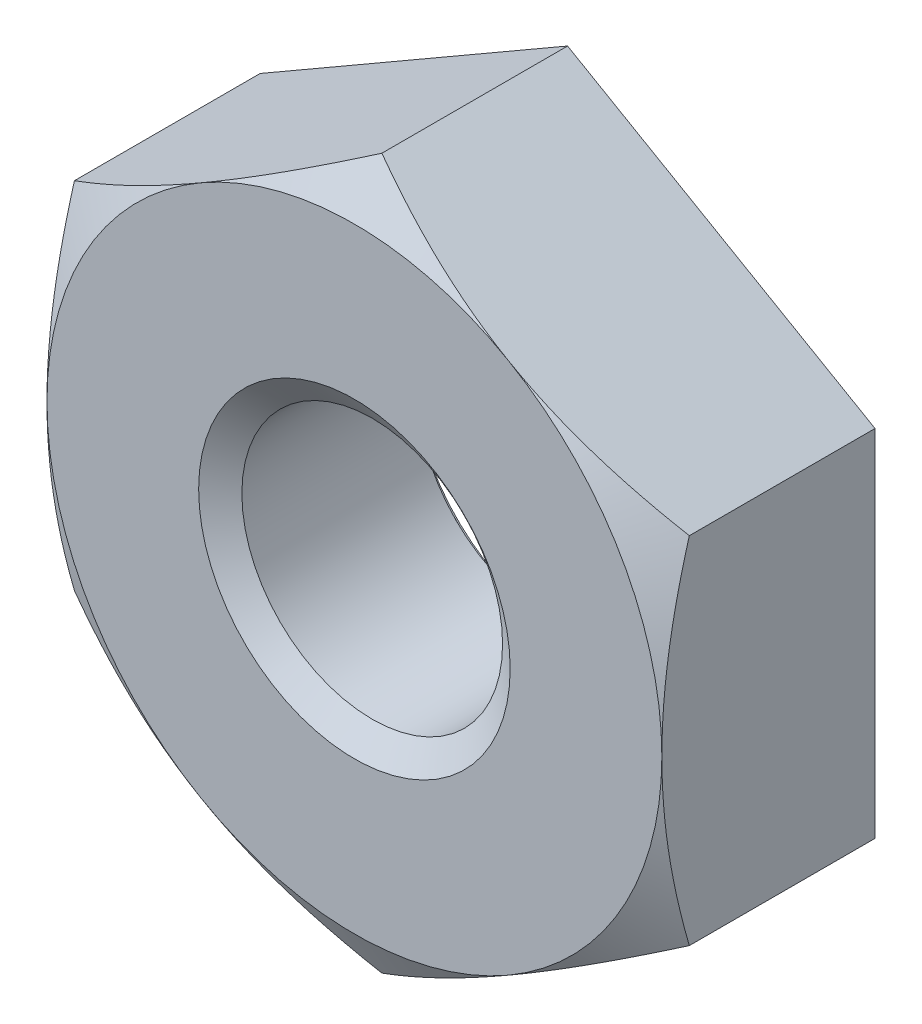
ISO-10303-21;
HEADER;
FILE_DESCRIPTION(('STEP AP214'),'2;1');
FILE_NAME('part.step','',(''),(''),'','','');
FILE_SCHEMA(('AUTOMOTIVE_DESIGN { 1 0 10303 214 1 1 1 1 }'));
ENDSEC;
DATA;
#1=APPLICATION_CONTEXT('core data for automotive mechanical design processes');
#2=APPLICATION_PROTOCOL_DEFINITION('international standard','automotive_design',2000,#1);
#3=PRODUCT_CONTEXT('',#1,'mechanical');
#4=PRODUCT('Part','Part','',(#3));
#5=PRODUCT_RELATED_PRODUCT_CATEGORY('part','',(#4));
#6=PRODUCT_DEFINITION_FORMATION('','',#4);
#7=PRODUCT_DEFINITION_CONTEXT('part definition',#1,'design');
#8=PRODUCT_DEFINITION('design','',#6,#7);
#9=PRODUCT_DEFINITION_SHAPE('','',#8);
#10=(LENGTH_UNIT() NAMED_UNIT(*) SI_UNIT(.MILLI.,.METRE.));
#11=(NAMED_UNIT(*) PLANE_ANGLE_UNIT() SI_UNIT($,.RADIAN.));
#12=(NAMED_UNIT(*) SI_UNIT($,.STERADIAN.) SOLID_ANGLE_UNIT());
#13=UNCERTAINTY_MEASURE_WITH_UNIT(LENGTH_MEASURE(1.E-05),#10,'distance_accuracy_value','');
#14=(GEOMETRIC_REPRESENTATION_CONTEXT(3) GLOBAL_UNCERTAINTY_ASSIGNED_CONTEXT((#13)) GLOBAL_UNIT_ASSIGNED_CONTEXT((#10,
#11,#12)) REPRESENTATION_CONTEXT('',''));
#15=CARTESIAN_POINT('',(0.,0.,0.));
#16=DIRECTION('',(0.,0.,1.));
#17=DIRECTION('',(1.,0.,0.));
#18=AXIS2_PLACEMENT_3D('',#15,#16,#17);
#19=CARTESIAN_POINT('',(0.,0.,-3.302));
#20=DIRECTION('',(0.,0.,1.));
#21=DIRECTION('',(1.,0.,0.));
#22=AXIS2_PLACEMENT_3D('',#19,#20,#21);
#23=CYLINDRICAL_SURFACE('',#22,2.0193);
#24=CARTESIAN_POINT('',(0.,0.,-0.27567170779316));
#25=DIRECTION('',(0.,0.,1.));
#26=DIRECTION('',(1.,0.,0.));
#27=AXIS2_PLACEMENT_3D('',#24,#25,#26);
#28=CIRCLE('',#27,2.0193);
#29=CARTESIAN_POINT('',(2.0193,0.,-0.27567170779316));
#30=VERTEX_POINT('',#29);
#31=EDGE_CURVE('E130',#30,#30,#28,.F.);
#32=ORIENTED_EDGE('',*,*,#31,.F.);
#33=EDGE_LOOP('',(#32));
#34=FACE_BOUND('',#33,.T.);
#35=CARTESIAN_POINT('',(0.,0.,-3.00092829220684));
#36=DIRECTION('',(0.,0.,-1.));
#37=DIRECTION('',(-1.,0.,0.));
#38=AXIS2_PLACEMENT_3D('',#35,#36,#37);
#39=CIRCLE('',#38,2.0193);
#40=CARTESIAN_POINT('',(-2.0193,0.,-3.00092829220684));
#41=VERTEX_POINT('',#40);
#42=EDGE_CURVE('E36',#41,#41,#39,.F.);
#43=ORIENTED_EDGE('',*,*,#42,.F.);
#44=EDGE_LOOP('',(#43));
#45=FACE_BOUND('',#44,.T.);
#46=ADVANCED_FACE('F31',(#34,#45),#23,.F.);
#47=CARTESIAN_POINT('',(0.,5.49926131403119,-3.302));
#48=DIRECTION('',(0.,0.,-1.));
#49=DIRECTION('',(-1.,0.,0.));
#50=AXIS2_PLACEMENT_3D('',#47,#48,#49);
#51=PLANE('',#50);
#52=DIRECTION('',(-0.866025403784438,-0.500000000000001,0.));
#53=VECTOR('',#52,1.);
#54=CARTESIAN_POINT('',(0.,5.49926131403119,-3.302));
#55=LINE('',#54,#53);
#56=CARTESIAN_POINT('',(0.,5.49926131403119,-3.302));
#57=VERTEX_POINT('',#56);
#58=CARTESIAN_POINT('',(-4.7625,2.74963065701559,-3.302));
#59=VERTEX_POINT('',#58);
#60=EDGE_CURVE('E257',#57,#59,#55,.T.);
#61=ORIENTED_EDGE('',*,*,#60,.F.);
#62=DIRECTION('',(-0.866025403784439,0.5,0.));
#63=VECTOR('',#62,1.);
#64=CARTESIAN_POINT('',(4.7625,2.74963065701559,-3.302));
#65=LINE('',#64,#63);
#66=CARTESIAN_POINT('',(4.7625,2.74963065701559,-3.302));
#67=VERTEX_POINT('',#66);
#68=EDGE_CURVE('E234',#67,#57,#65,.T.);
#69=ORIENTED_EDGE('',*,*,#68,.F.);
#70=DIRECTION('',(0.,-1.,0.));
#71=VECTOR('',#70,1.);
#72=CARTESIAN_POINT('',(4.7625,2.74963065701559,-3.302));
#73=LINE('',#72,#71);
#74=CARTESIAN_POINT('',(4.7625,-2.7496306570156,-3.302));
#75=VERTEX_POINT('',#74);
#76=EDGE_CURVE('E246',#67,#75,#73,.T.);
#77=ORIENTED_EDGE('',*,*,#76,.T.);
#78=DIRECTION('',(0.866025403784438,0.5,0.));
#79=VECTOR('',#78,1.);
#80=CARTESIAN_POINT('',(0.,-5.49926131403119,-3.302));
#81=LINE('',#80,#79);
#82=CARTESIAN_POINT('',(0.,-5.49926131403119,-3.302));
#83=VERTEX_POINT('',#82);
#84=EDGE_CURVE('E248',#83,#75,#81,.T.);
#85=ORIENTED_EDGE('',*,*,#84,.F.);
#86=DIRECTION('',(0.866025403784439,-0.5,0.));
#87=VECTOR('',#86,1.);
#88=CARTESIAN_POINT('',(-4.7625,-2.7496306570156,-3.302));
#89=LINE('',#88,#87);
#90=CARTESIAN_POINT('',(-4.7625,-2.7496306570156,-3.302));
#91=VERTEX_POINT('',#90);
#92=EDGE_CURVE('E251',#91,#83,#89,.T.);
#93=ORIENTED_EDGE('',*,*,#92,.F.);
#94=DIRECTION('',(0.,-1.,0.));
#95=VECTOR('',#94,1.);
#96=CARTESIAN_POINT('',(-4.7625,2.74963065701559,-3.302));
#97=LINE('',#96,#95);
#98=EDGE_CURVE('E254',#59,#91,#97,.T.);
#99=ORIENTED_EDGE('',*,*,#98,.F.);
#100=EDGE_LOOP('',(#61,#69,#77,#85,#93,#99));
#101=FACE_BOUND('',#100,.T.);
#102=CARTESIAN_POINT('',(0.,0.,-3.302));
#103=DIRECTION('',(0.,0.,-1.));
#104=DIRECTION('',(-1.,0.,0.));
#105=AXIS2_PLACEMENT_3D('',#102,#103,#104);
#106=CIRCLE('',#105,2.413);
#107=CARTESIAN_POINT('',(-2.413,0.,-3.302));
#108=VERTEX_POINT('',#107);
#109=EDGE_CURVE('E218',#108,#108,#106,.F.);
#110=ORIENTED_EDGE('',*,*,#109,.T.);
#111=EDGE_LOOP('',(#110));
#112=FACE_BOUND('',#111,.T.);
#113=ADVANCED_FACE('F205',(#101,#112),#51,.T.);
#114=CARTESIAN_POINT('',(0.,5.49926131403119,0.));
#115=DIRECTION('',(0.,0.,-1.));
#116=DIRECTION('',(-1.,0.,0.));
#117=AXIS2_PLACEMENT_3D('',#114,#115,#116);
#118=PLANE('',#117);
#119=CARTESIAN_POINT('',(0.,0.,0.));
#120=DIRECTION('',(0.,0.,-1.));
#121=DIRECTION('',(-1.,0.,0.));
#122=AXIS2_PLACEMENT_3D('',#119,#120,#121);
#123=CIRCLE('',#122,4.7625);
#124=CARTESIAN_POINT('',(-2.38125,4.12444598552339,0.));
#125=VERTEX_POINT('',#124);
#126=CARTESIAN_POINT('',(-4.7625,0.,0.));
#127=VERTEX_POINT('',#126);
#128=EDGE_CURVE('E43',#125,#127,#123,.F.);
#129=ORIENTED_EDGE('',*,*,#128,.T.);
#130=CARTESIAN_POINT('',(-2.38125,-4.12444598552339,0.));
#131=VERTEX_POINT('',#130);
#132=EDGE_CURVE('E11',#127,#131,#123,.F.);
#133=ORIENTED_EDGE('',*,*,#132,.T.);
#134=CARTESIAN_POINT('',(2.38125,-4.12444598552339,0.));
#135=VERTEX_POINT('',#134);
#136=EDGE_CURVE('E41',#131,#135,#123,.F.);
#137=ORIENTED_EDGE('',*,*,#136,.T.);
#138=CARTESIAN_POINT('',(4.7625,0.,0.));
#139=VERTEX_POINT('',#138);
#140=EDGE_CURVE('E109',#135,#139,#123,.F.);
#141=ORIENTED_EDGE('',*,*,#140,.T.);
#142=CARTESIAN_POINT('',(0.,0.,0.));
#143=DIRECTION('',(0.,0.,1.));
#144=DIRECTION('',(1.,0.,0.));
#145=AXIS2_PLACEMENT_3D('',#142,#143,#144);
#146=CIRCLE('',#145,4.7625);
#147=CARTESIAN_POINT('',(2.38125,4.12444598552339,0.));
#148=VERTEX_POINT('',#147);
#149=EDGE_CURVE('E121',#139,#148,#146,.T.);
#150=ORIENTED_EDGE('',*,*,#149,.T.);
#151=EDGE_CURVE('E136',#148,#125,#123,.F.);
#152=ORIENTED_EDGE('',*,*,#151,.T.);
#153=EDGE_LOOP('',(#129,#133,#137,#141,#150,#152));
#154=FACE_BOUND('',#153,.T.);
#155=CARTESIAN_POINT('',(0.,0.,0.));
#156=DIRECTION('',(0.,0.,1.));
#157=DIRECTION('',(1.,0.,0.));
#158=AXIS2_PLACEMENT_3D('',#155,#156,#157);
#159=CIRCLE('',#158,2.413);
#160=CARTESIAN_POINT('',(2.413,0.,0.));
#161=VERTEX_POINT('',#160);
#162=EDGE_CURVE('E217',#161,#161,#159,.T.);
#163=ORIENTED_EDGE('',*,*,#162,.F.);
#164=EDGE_LOOP('',(#163));
#165=FACE_BOUND('',#164,.T.);
#166=ADVANCED_FACE('F133',(#154,#165),#118,.F.);
#167=CARTESIAN_POINT('',(0.,5.49926131403119,-3.302));
#168=DIRECTION('',(-0.5,0.866025403784438,0.));
#169=DIRECTION('',(-0.866025403784438,-0.500000000000001,0.));
#170=AXIS2_PLACEMENT_3D('',#167,#168,#169);
#171=PLANE('',#170);
#172=DIRECTION('',(0.,0.,1.));
#173=VECTOR('',#172,1.);
#174=CARTESIAN_POINT('',(-4.7625,2.74963065701559,-3.302));
#175=LINE('',#174,#173);
#176=CARTESIAN_POINT('',(-4.7625,2.74963065701559,-0.42536934298441));
#177=VERTEX_POINT('',#176);
#178=EDGE_CURVE('E230',#59,#177,#175,.T.);
#179=ORIENTED_EDGE('',*,*,#178,.T.);
#180=CARTESIAN_POINT('',(-4.7627,2.74951518696175,-0.425436011750768));
#181=CARTESIAN_POINT('',(-4.55340263838612,2.8703530750302,-0.355653612413945));
#182=CARTESIAN_POINT('',(-4.34231515161877,2.9922244923379,-0.292183264615225));
#183=CARTESIAN_POINT('',(-3.91648500907589,3.23807763976409,-0.181395196068724));
#184=CARTESIAN_POINT('',(-3.701734787416,3.36206373804796,-0.134116665429796));
#185=CARTESIAN_POINT('',(-3.27486304406647,3.60851825398025,-0.0605335253687851));
#186=CARTESIAN_POINT('',(-3.06280800150458,3.73094828988637,-0.0337387922017274));
#187=CARTESIAN_POINT('',(-2.7439794939507,3.91502401454793,-0.00971112218087747));
#188=CARTESIAN_POINT('',(-2.63763059112771,3.97642458222081,-0.00439464100931433));
#189=CARTESIAN_POINT('',(-2.42483449751002,4.09928246415348,0.000759836568293844));
#190=CARTESIAN_POINT('',(-2.31838730985274,4.1607397766019,0.000598002190792765));
#191=CARTESIAN_POINT('',(-2.02675051194544,4.32911636037927,-0.00738494982191029));
#192=CARTESIAN_POINT('',(-1.84165753319303,4.43597984148709,-0.0207924204878941));
#193=CARTESIAN_POINT('',(-1.47270002105863,4.64899756043742,-0.0633078628436922));
#194=CARTESIAN_POINT('',(-1.28883678458933,4.75515104950704,-0.0924303682801015));
#195=CARTESIAN_POINT('',(-0.919135889202232,4.96859796097843,-0.165229253586901));
#196=CARTESIAN_POINT('',(-0.733344890273213,5.07586444422311,-0.209214113046655));
#197=CARTESIAN_POINT('',(-0.364533730991679,5.28879766631444,-0.309042279938828));
#198=CARTESIAN_POINT('',(-0.181508846544093,5.39446713261866,-0.364862134678058));
#199=CARTESIAN_POINT('',(0.000199999999998928,5.49937678408502,-0.425436011750769));
#200=B_SPLINE_CURVE_WITH_KNOTS('',3,(#180,#181,#182,#183,#184,#185,#186,#187,#188,#189,#190,
#191,#192,#193,#194,#195,#196,#197,#198,#199),.UNSPECIFIED.,.F.,.F.,(4,2,2,2,2,2,2,2,2,4),(0.,
0.754910190012918,1.51163483480638,2.24963134670895,2.61827336240839,2.9869039913527,
3.6286742319225,4.27103902109237,4.92765153591996,5.58297484368455),.UNSPECIFIED.);
#201=EDGE_CURVE('E55',#177,#125,#200,.T.);
#202=ORIENTED_EDGE('',*,*,#201,.T.);
#203=CARTESIAN_POINT('',(0.,5.49926131403119,-0.425369342984409));
#204=VERTEX_POINT('',#203);
#205=EDGE_CURVE('E144',#125,#204,#200,.T.);
#206=ORIENTED_EDGE('',*,*,#205,.T.);
#207=DIRECTION('',(0.,0.,1.));
#208=VECTOR('',#207,1.);
#209=CARTESIAN_POINT('',(0.,5.49926131403119,-3.302));
#210=LINE('',#209,#208);
#211=EDGE_CURVE('E229',#57,#204,#210,.T.);
#212=ORIENTED_EDGE('',*,*,#211,.F.);
#213=ORIENTED_EDGE('',*,*,#60,.T.);
#214=EDGE_LOOP('',(#179,#202,#206,#212,#213));
#215=FACE_BOUND('',#214,.T.);
#216=ADVANCED_FACE('F33',(#215),#171,.T.);
#217=CARTESIAN_POINT('',(4.7625,2.74963065701559,-3.302));
#218=DIRECTION('',(0.5,0.866025403784438,0.));
#219=DIRECTION('',(-0.866025403784439,0.5,0.));
#220=AXIS2_PLACEMENT_3D('',#217,#218,#219);
#221=PLANE('',#220);
#222=ORIENTED_EDGE('',*,*,#211,.T.);
#223=CARTESIAN_POINT('',(-0.00020000000000067,5.49937678408502,-0.425436011750769));
#224=CARTESIAN_POINT('',(0.209097361613878,5.37853889601657,-0.355653612413946));
#225=CARTESIAN_POINT('',(0.420184848381228,5.25666747870888,-0.292183264615225));
#226=CARTESIAN_POINT('',(0.846014990924114,5.01081433128269,-0.181395196068724));
#227=CARTESIAN_POINT('',(1.060765212584,4.88682823299882,-0.134116665429797));
#228=CARTESIAN_POINT('',(1.48763695593353,4.64037371706653,-0.0605335253687856));
#229=CARTESIAN_POINT('',(1.69969199849542,4.51794368116041,-0.0337387922017277));
#230=CARTESIAN_POINT('',(2.0185205060493,4.33386795649884,-0.00971112218087749));
#231=CARTESIAN_POINT('',(2.12486940887228,4.27246738882597,-0.00439464100931429));
#232=CARTESIAN_POINT('',(2.33766550248998,4.14960950689329,0.000759836568294039));
#233=CARTESIAN_POINT('',(2.44411269014726,4.08815219444488,0.000598002190793063));
#234=CARTESIAN_POINT('',(2.73574948805456,3.9197756106675,-0.00738494982190979));
#235=CARTESIAN_POINT('',(2.92084246680697,3.81291212955969,-0.0207924204878935));
#236=CARTESIAN_POINT('',(3.28979997894137,3.59989441060936,-0.0633078628436916));
#237=CARTESIAN_POINT('',(3.47366321541067,3.49374092153973,-0.092430368280101));
#238=CARTESIAN_POINT('',(3.84336411079777,3.28029401006835,-0.165229253586901));
#239=CARTESIAN_POINT('',(4.02915510972679,3.17302752682367,-0.209214113046654));
#240=CARTESIAN_POINT('',(4.39796626900832,2.96009430473234,-0.309042279938827));
#241=CARTESIAN_POINT('',(4.58099115345591,2.85442483842812,-0.364862134678057));
#242=CARTESIAN_POINT('',(4.7627,2.74951518696175,-0.425436011750768));
#243=B_SPLINE_CURVE_WITH_KNOTS('',3,(#223,#224,#225,#226,#227,#228,#229,#230,#231,#232,#233,
#234,#235,#236,#237,#238,#239,#240,#241,#242),.UNSPECIFIED.,.F.,.F.,(4,2,2,2,2,2,2,2,2,4),(0.,
0.754910190012917,1.51163483480638,2.24963134670895,2.61827336240839,2.9869039913527,
3.6286742319225,4.27103902109237,4.92765153591996,5.58297484368455),.UNSPECIFIED.);
#244=EDGE_CURVE('E141',#204,#148,#243,.T.);
#245=ORIENTED_EDGE('',*,*,#244,.T.);
#246=CARTESIAN_POINT('',(4.7625,2.74963065701559,-0.425369342984409));
#247=VERTEX_POINT('',#246);
#248=EDGE_CURVE('E124',#148,#247,#243,.T.);
#249=ORIENTED_EDGE('',*,*,#248,.T.);
#250=DIRECTION('',(0.,0.,1.));
#251=VECTOR('',#250,1.);
#252=CARTESIAN_POINT('',(4.7625,2.74963065701559,-3.302));
#253=LINE('',#252,#251);
#254=EDGE_CURVE('E140',#67,#247,#253,.T.);
#255=ORIENTED_EDGE('',*,*,#254,.F.);
#256=ORIENTED_EDGE('',*,*,#68,.T.);
#257=EDGE_LOOP('',(#222,#245,#249,#255,#256));
#258=FACE_BOUND('',#257,.T.);
#259=ADVANCED_FACE('F262',(#258),#221,.T.);
#260=CARTESIAN_POINT('',(4.7625,2.74963065701559,-3.302));
#261=DIRECTION('',(-1.,0.,0.));
#262=DIRECTION('',(0.,0.,1.));
#263=AXIS2_PLACEMENT_3D('',#260,#261,#262);
#264=PLANE('',#263);
#265=CARTESIAN_POINT('',(4.7625,-7.29242571304484,-2.27898343403964));
#266=CARTESIAN_POINT('',(4.7625,-7.08332503258644,-2.17793443460892));
#267=CARTESIAN_POINT('',(4.7625,-6.87372996761939,-2.07788994627171));
#268=CARTESIAN_POINT('',(4.7625,-6.45328375890254,-1.88038400304187));
#269=CARTESIAN_POINT('',(4.7625,-6.24243240531598,-1.78292299537275));
#270=CARTESIAN_POINT('',(4.7625,-5.818067307616,-1.59064459480452));
#271=CARTESIAN_POINT('',(4.7625,-5.60454523269943,-1.49584552190854));
#272=CARTESIAN_POINT('',(4.7625,-5.17574610716181,-1.31031922922938));
#273=CARTESIAN_POINT('',(4.7625,-4.96046914871243,-1.21959179719919));
#274=CARTESIAN_POINT('',(4.7625,-4.5251454275538,-1.04221436450315));
#275=CARTESIAN_POINT('',(4.7625,-4.30507255346546,-0.955628096677137));
#276=CARTESIAN_POINT('',(4.7625,-3.86233085885286,-0.789237026079921));
#277=CARTESIAN_POINT('',(4.7625,-3.6396617526365,-0.709432977795151));
#278=CARTESIAN_POINT('',(4.7625,-3.19183146915336,-0.558750437330524));
#279=CARTESIAN_POINT('',(4.7625,-2.96667674136295,-0.487852969464109));
#280=CARTESIAN_POINT('',(4.7625,-2.51316408606383,-0.357286935151366));
#281=CARTESIAN_POINT('',(4.7625,-2.28480719615868,-0.297614817726104));
#282=CARTESIAN_POINT('',(4.7625,-1.82474524250015,-0.192393335725106));
#283=CARTESIAN_POINT('',(4.7625,-1.59303930440612,-0.146847731515044));
#284=CARTESIAN_POINT('',(4.7625,-1.12680140245445,-0.0729572667243255));
#285=CARTESIAN_POINT('',(4.7625,-0.892269436098447,-0.044612421351302));
#286=CARTESIAN_POINT('',(4.7625,-0.540098243423059,-0.0168127698224292));
#287=CARTESIAN_POINT('',(4.7625,-0.423010288487476,-0.00999774479560567));
#288=CARTESIAN_POINT('',(4.7625,-0.188645495023605,-0.00132916739532982));
#289=CARTESIAN_POINT('',(4.7625,-0.0713686589679978,0.000524449409052416));
#290=CARTESIAN_POINT('',(4.7625,0.163123105354889,-0.00077959532675014));
#291=CARTESIAN_POINT('',(4.7625,0.280338041752276,-0.00393584200216364));
#292=CARTESIAN_POINT('',(4.7625,0.514533140154533,-0.0151795737408435));
#293=CARTESIAN_POINT('',(4.7625,0.631513289308025,-0.0232673217280265));
#294=CARTESIAN_POINT('',(4.7625,0.915050030184752,-0.0486788919016494));
#295=CARTESIAN_POINT('',(4.7625,1.08138937418057,-0.0684745311551046));
#296=CARTESIAN_POINT('',(4.7625,1.41276151801412,-0.116933997609662));
#297=CARTESIAN_POINT('',(4.7625,1.57779414061616,-0.145599007360524));
#298=CARTESIAN_POINT('',(4.7625,2.07083902042289,-0.243383100627567));
#299=CARTESIAN_POINT('',(4.7625,2.39654516294854,-0.324265654459847));
#300=CARTESIAN_POINT('',(4.7625,2.88391142522151,-0.463767781303893));
#301=CARTESIAN_POINT('',(4.7625,3.04811363656015,-0.514009375908408));
#302=CARTESIAN_POINT('',(4.7625,3.37480455011008,-0.619463864370054));
#303=CARTESIAN_POINT('',(4.7625,3.53729434901436,-0.674673329356533));
#304=CARTESIAN_POINT('',(4.7625,3.85988055284394,-0.788914900372858));
#305=CARTESIAN_POINT('',(4.7625,4.01998528140539,-0.847923740867389));
#306=CARTESIAN_POINT('',(4.7625,4.33895253974561,-0.969404920092012));
#307=CARTESIAN_POINT('',(4.7625,4.49781453744471,-1.03187865865025));
#308=CARTESIAN_POINT('',(4.7625,4.65610216606021,-1.09574291091383));
#309=B_SPLINE_CURVE_WITH_KNOTS('',3,(#265,#266,#267,#268,#269,#270,#271,#272,#273,#274,#275,
#276,#277,#278,#279,#280,#281,#282,#283,#284,#285,#286,#287,#288,#289,#290,#291,#292,#293,#294,
#295,#296,#297,#298,#299,#300,#301,#302,#303,#304,#305,#306,#307,#308),.UNSPECIFIED.,.F.,.F.,(4,
2,2,2,2,2,2,2,2,2,2,2,2,2,2,2,2,2,2,2,2,4),(0.,0.696720165483736,1.39356016205725,
2.09438789250382,2.79517904757872,3.50457374312629,4.21404725210227,4.92198260780581,
5.62969364031721,6.33759289852653,7.04549278260687,7.39726182154395,7.74902629223847,
8.10069143675107,8.45237533199633,8.95462912158064,9.45694990534677,10.4623513294482,
10.9774608355396,11.4922174961111,12.0040767603637,12.5161443452105),.UNSPECIFIED.);
#310=CARTESIAN_POINT('',(4.7625,-2.74963065701559,-0.425369342984409));
#311=VERTEX_POINT('',#310);
#312=EDGE_CURVE('E105',#311,#139,#309,.T.);
#313=ORIENTED_EDGE('',*,*,#312,.F.);
#314=DIRECTION('',(0.,0.,1.));
#315=VECTOR('',#314,1.);
#316=CARTESIAN_POINT('',(4.7625,-2.7496306570156,-3.302));
#317=LINE('',#316,#315);
#318=EDGE_CURVE('E239',#75,#311,#317,.T.);
#319=ORIENTED_EDGE('',*,*,#318,.F.);
#320=ORIENTED_EDGE('',*,*,#76,.F.);
#321=ORIENTED_EDGE('',*,*,#254,.T.);
#322=EDGE_CURVE('E118',#139,#247,#309,.T.);
#323=ORIENTED_EDGE('',*,*,#322,.F.);
#324=EDGE_LOOP('',(#313,#319,#320,#321,#323));
#325=FACE_BOUND('',#324,.T.);
#326=ADVANCED_FACE('F138',(#325),#264,.F.);
#327=CARTESIAN_POINT('',(0.,-5.49926131403119,-3.302));
#328=DIRECTION('',(0.5,-0.866025403784438,0.));
#329=DIRECTION('',(0.866025403784438,0.5,0.));
#330=AXIS2_PLACEMENT_3D('',#327,#328,#329);
#331=PLANE('',#330);
#332=ORIENTED_EDGE('',*,*,#318,.T.);
#333=CARTESIAN_POINT('',(4.7627,-2.74951518696176,-0.425436011750769));
#334=CARTESIAN_POINT('',(4.55340263838612,-2.87035307503021,-0.355653612413947));
#335=CARTESIAN_POINT('',(4.34231515161877,-2.9922244923379,-0.292183264615227));
#336=CARTESIAN_POINT('',(3.91648500907589,-3.23807763976409,-0.181395196068726));
#337=CARTESIAN_POINT('',(3.701734787416,-3.36206373804796,-0.134116665429798));
#338=CARTESIAN_POINT('',(3.27486304406647,-3.60851825398026,-0.0605335253687871));
#339=CARTESIAN_POINT('',(3.06280800150458,-3.73094828988638,-0.0337387922017295));
#340=CARTESIAN_POINT('',(2.7439794939507,-3.91502401454794,-0.0097111221808794));
#341=CARTESIAN_POINT('',(2.63763059112771,-3.97642458222081,-0.00439464100931616));
#342=CARTESIAN_POINT('',(2.42483449751002,-4.09928246415349,0.000759836568291913));
#343=CARTESIAN_POINT('',(2.31838730985274,-4.1607397766019,0.000598002190790622));
#344=CARTESIAN_POINT('',(2.02675051194544,-4.32911636037928,-0.00738494982191273));
#345=CARTESIAN_POINT('',(1.84165753319303,-4.43597984148709,-0.0207924204878963));
#346=CARTESIAN_POINT('',(1.47270002105863,-4.64899756043742,-0.0633078628436945));
#347=CARTESIAN_POINT('',(1.28883678458933,-4.75515104950705,-0.0924303682801041));
#348=CARTESIAN_POINT('',(0.919135889202232,-4.96859796097843,-0.165229253586904));
#349=CARTESIAN_POINT('',(0.733344890273213,-5.07586444422311,-0.209214113046657));
#350=CARTESIAN_POINT('',(0.364533730991679,-5.28879766631445,-0.30904227993883));
#351=CARTESIAN_POINT('',(0.181508846544093,-5.39446713261866,-0.36486213467806));
#352=CARTESIAN_POINT('',(-0.000199999999998893,-5.49937678408503,-0.425436011750771));
#353=B_SPLINE_CURVE_WITH_KNOTS('',3,(#333,#334,#335,#336,#337,#338,#339,#340,#341,#342,#343,
#344,#345,#346,#347,#348,#349,#350,#351,#352),.UNSPECIFIED.,.F.,.F.,(4,2,2,2,2,2,2,2,2,4),(0.,
0.754910190012918,1.51163483480638,2.24963134670895,2.61827336240839,2.9869039913527,
3.6286742319225,4.27103902109237,4.92765153591996,5.58297484368455),.UNSPECIFIED.);
#354=EDGE_CURVE('E112',#311,#135,#353,.T.);
#355=ORIENTED_EDGE('',*,*,#354,.T.);
#356=CARTESIAN_POINT('',(0.,-5.49926131403119,-0.425369342984409));
#357=VERTEX_POINT('',#356);
#358=EDGE_CURVE('E151',#135,#357,#353,.T.);
#359=ORIENTED_EDGE('',*,*,#358,.T.);
#360=DIRECTION('',(0.,0.,1.));
#361=VECTOR('',#360,1.);
#362=CARTESIAN_POINT('',(0.,-5.49926131403119,-3.302));
#363=LINE('',#362,#361);
#364=EDGE_CURVE('E236',#83,#357,#363,.T.);
#365=ORIENTED_EDGE('',*,*,#364,.F.);
#366=ORIENTED_EDGE('',*,*,#84,.T.);
#367=EDGE_LOOP('',(#332,#355,#359,#365,#366));
#368=FACE_BOUND('',#367,.T.);
#369=ADVANCED_FACE('F193',(#368),#331,.T.);
#370=CARTESIAN_POINT('',(-4.7625,-2.7496306570156,-3.302));
#371=DIRECTION('',(-0.5,-0.866025403784438,0.));
#372=DIRECTION('',(0.866025403784439,-0.5,0.));
#373=AXIS2_PLACEMENT_3D('',#370,#371,#372);
#374=PLANE('',#373);
#375=ORIENTED_EDGE('',*,*,#364,.T.);
#376=CARTESIAN_POINT('',(0.000200000000000501,-5.49937678408503,-0.425436011750772));
#377=CARTESIAN_POINT('',(-0.209097361613878,-5.37853889601658,-0.355653612413949));
#378=CARTESIAN_POINT('',(-0.420184848381229,-5.25666747870889,-0.292183264615228));
#379=CARTESIAN_POINT('',(-0.846014990924115,-5.01081433128269,-0.181395196068727));
#380=CARTESIAN_POINT('',(-1.060765212584,-4.88682823299882,-0.134116665429799));
#381=CARTESIAN_POINT('',(-1.48763695593353,-4.64037371706653,-0.0605335253687881));
#382=CARTESIAN_POINT('',(-1.69969199849542,-4.51794368116041,-0.0337387922017307));
#383=CARTESIAN_POINT('',(-2.0185205060493,-4.33386795649885,-0.00971112218088012));
#384=CARTESIAN_POINT('',(-2.12486940887229,-4.27246738882597,-0.00439464100931657));
#385=CARTESIAN_POINT('',(-2.33766550248998,-4.1496095068933,0.000759836568291579));
#386=CARTESIAN_POINT('',(-2.44411269014727,-4.08815219444489,0.000598002190790061));
#387=CARTESIAN_POINT('',(-2.73574948805456,-3.91977561066751,-0.00738494982191347));
#388=CARTESIAN_POINT('',(-2.92084246680697,-3.8129121295597,-0.0207924204878967));
#389=CARTESIAN_POINT('',(-3.28979997894137,-3.59989441060936,-0.0633078628436941));
#390=CARTESIAN_POINT('',(-3.47366321541067,-3.49374092153974,-0.0924303682801032));
#391=CARTESIAN_POINT('',(-3.84336411079777,-3.28029401006835,-0.165229253586903));
#392=CARTESIAN_POINT('',(-4.02915510972679,-3.17302752682367,-0.209214113046656));
#393=CARTESIAN_POINT('',(-4.39796626900832,-2.96009430473234,-0.309042279938829));
#394=CARTESIAN_POINT('',(-4.58099115345591,-2.85442483842813,-0.364862134678059));
#395=CARTESIAN_POINT('',(-4.7627,-2.74951518696176,-0.42543601175077));
#396=B_SPLINE_CURVE_WITH_KNOTS('',3,(#376,#377,#378,#379,#380,#381,#382,#383,#384,#385,#386,
#387,#388,#389,#390,#391,#392,#393,#394,#395),.UNSPECIFIED.,.F.,.F.,(4,2,2,2,2,2,2,2,2,4),(0.,
0.754910190012919,1.51163483480638,2.24963134670895,2.6182733624084,2.9869039913527,
3.6286742319225,4.27103902109237,4.92765153591997,5.58297484368455),.UNSPECIFIED.);
#397=EDGE_CURVE('E187',#357,#131,#396,.T.);
#398=ORIENTED_EDGE('',*,*,#397,.T.);
#399=CARTESIAN_POINT('',(-4.7625,-2.74963065701559,-0.425369342984409));
#400=VERTEX_POINT('',#399);
#401=EDGE_CURVE('E180',#131,#400,#396,.T.);
#402=ORIENTED_EDGE('',*,*,#401,.T.);
#403=DIRECTION('',(0.,0.,1.));
#404=VECTOR('',#403,1.);
#405=CARTESIAN_POINT('',(-4.7625,-2.7496306570156,-3.302));
#406=LINE('',#405,#404);
#407=EDGE_CURVE('E233',#91,#400,#406,.T.);
#408=ORIENTED_EDGE('',*,*,#407,.F.);
#409=ORIENTED_EDGE('',*,*,#92,.T.);
#410=EDGE_LOOP('',(#375,#398,#402,#408,#409));
#411=FACE_BOUND('',#410,.T.);
#412=ADVANCED_FACE('F189',(#411),#374,.T.);
#413=CARTESIAN_POINT('',(-4.7625,2.74963065701559,-3.302));
#414=DIRECTION('',(-1.,0.,0.));
#415=DIRECTION('',(0.,0.,1.));
#416=AXIS2_PLACEMENT_3D('',#413,#414,#415);
#417=PLANE('',#416);
#418=ORIENTED_EDGE('',*,*,#407,.T.);
#419=CARTESIAN_POINT('',(-4.7625,-7.29242571304484,-2.27898343403964));
#420=CARTESIAN_POINT('',(-4.7625,-7.08332503258644,-2.17793443460892));
#421=CARTESIAN_POINT('',(-4.7625,-6.87372996761939,-2.07788994627171));
#422=CARTESIAN_POINT('',(-4.7625,-6.45328375890254,-1.88038400304187));
#423=CARTESIAN_POINT('',(-4.7625,-6.24243240531598,-1.78292299537275));
#424=CARTESIAN_POINT('',(-4.7625,-5.818067307616,-1.59064459480452));
#425=CARTESIAN_POINT('',(-4.7625,-5.60454523269943,-1.49584552190854));
#426=CARTESIAN_POINT('',(-4.7625,-5.17574610716181,-1.31031922922938));
#427=CARTESIAN_POINT('',(-4.7625,-4.96046914871243,-1.21959179719919));
#428=CARTESIAN_POINT('',(-4.7625,-4.5251454275538,-1.04221436450315));
#429=CARTESIAN_POINT('',(-4.7625,-4.30507255346547,-0.955628096677138));
#430=CARTESIAN_POINT('',(-4.7625,-3.86233085885286,-0.789237026079922));
#431=CARTESIAN_POINT('',(-4.7625,-3.6396617526365,-0.709432977795152));
#432=CARTESIAN_POINT('',(-4.7625,-3.19183146915336,-0.558750437330524));
#433=CARTESIAN_POINT('',(-4.7625,-2.96667674136296,-0.48785296946411));
#434=CARTESIAN_POINT('',(-4.7625,-2.51316408606383,-0.357286935151366));
#435=CARTESIAN_POINT('',(-4.7625,-2.28480719615869,-0.297614817726105));
#436=CARTESIAN_POINT('',(-4.7625,-1.82474524250015,-0.192393335725107));
#437=CARTESIAN_POINT('',(-4.7625,-1.59303930440612,-0.146847731515045));
#438=CARTESIAN_POINT('',(-4.7625,-1.12680140245446,-0.0729572667243258));
#439=CARTESIAN_POINT('',(-4.7625,-0.89226943609845,-0.044612421351302));
#440=CARTESIAN_POINT('',(-4.7625,-0.540098243423061,-0.0168127698224291));
#441=CARTESIAN_POINT('',(-4.7625,-0.423010288487478,-0.00999774479560567));
#442=CARTESIAN_POINT('',(-4.7625,-0.188645495023607,-0.00132916739532986));
#443=CARTESIAN_POINT('',(-4.7625,-0.0713686589679995,0.000524449409052396));
#444=CARTESIAN_POINT('',(-4.7625,0.163123105354887,-0.000779595326750123));
#445=CARTESIAN_POINT('',(-4.7625,0.280338041752275,-0.00393584200216362));
#446=CARTESIAN_POINT('',(-4.7625,0.514533140154532,-0.0151795737408435));
#447=CARTESIAN_POINT('',(-4.7625,0.631513289308023,-0.0232673217280265));
#448=CARTESIAN_POINT('',(-4.7625,0.915050030184751,-0.0486788919016494));
#449=CARTESIAN_POINT('',(-4.7625,1.08138937418057,-0.0684745311551047));
#450=CARTESIAN_POINT('',(-4.7625,1.41276151801412,-0.116933997609662));
#451=CARTESIAN_POINT('',(-4.7625,1.57779414061616,-0.145599007360524));
#452=CARTESIAN_POINT('',(-4.7625,2.07083902042289,-0.243383100627567));
#453=CARTESIAN_POINT('',(-4.7625,2.39654516294854,-0.324265654459847));
#454=CARTESIAN_POINT('',(-4.7625,2.88391142522151,-0.463767781303893));
#455=CARTESIAN_POINT('',(-4.7625,3.04811363656015,-0.514009375908408));
#456=CARTESIAN_POINT('',(-4.7625,3.37480455011008,-0.619463864370054));
#457=CARTESIAN_POINT('',(-4.7625,3.53729434901436,-0.674673329356533));
#458=CARTESIAN_POINT('',(-4.7625,3.85988055284394,-0.788914900372858));
#459=CARTESIAN_POINT('',(-4.7625,4.01998528140539,-0.847923740867388));
#460=CARTESIAN_POINT('',(-4.7625,4.33895253974561,-0.969404920092012));
#461=CARTESIAN_POINT('',(-4.7625,4.49781453744471,-1.03187865865025));
#462=CARTESIAN_POINT('',(-4.7625,4.65610216606021,-1.09574291091383));
#463=B_SPLINE_CURVE_WITH_KNOTS('',3,(#419,#420,#421,#422,#423,#424,#425,#426,#427,#428,#429,
#430,#431,#432,#433,#434,#435,#436,#437,#438,#439,#440,#441,#442,#443,#444,#445,#446,#447,#448,
#449,#450,#451,#452,#453,#454,#455,#456,#457,#458,#459,#460,#461,#462),.UNSPECIFIED.,.F.,.F.,(4,
2,2,2,2,2,2,2,2,2,2,2,2,2,2,2,2,2,2,2,2,4),(0.,0.696720165483736,1.39356016205726,
2.09438789250382,2.79517904757872,3.50457374312629,4.21404725210227,4.92198260780581,
5.6296936403172,6.33759289852653,7.04549278260687,7.39726182154395,7.74902629223847,
8.10069143675107,8.45237533199633,8.95462912158064,9.45694990534677,10.4623513294482,
10.9774608355396,11.4922174961111,12.0040767603637,12.5161443452105),.UNSPECIFIED.);
#464=EDGE_CURVE('E188',#400,#127,#463,.T.);
#465=ORIENTED_EDGE('',*,*,#464,.T.);
#466=EDGE_CURVE('E129',#127,#177,#463,.T.);
#467=ORIENTED_EDGE('',*,*,#466,.T.);
#468=ORIENTED_EDGE('',*,*,#178,.F.);
#469=ORIENTED_EDGE('',*,*,#98,.T.);
#470=EDGE_LOOP('',(#418,#465,#467,#468,#469));
#471=FACE_BOUND('',#470,.T.);
#472=ADVANCED_FACE('F192',(#471),#417,.T.);
#473=CARTESIAN_POINT('',(0.,0.,0.));
#474=DIRECTION('',(0.,0.,-1.));
#475=DIRECTION('',(-1.,0.,0.));
#476=AXIS2_PLACEMENT_3D('',#473,#474,#475);
#477=CONICAL_SURFACE('',#476,4.7625,1.0471975511966);
#478=ORIENTED_EDGE('',*,*,#466,.F.);
#479=ORIENTED_EDGE('',*,*,#128,.F.);
#480=ORIENTED_EDGE('',*,*,#201,.F.);
#481=EDGE_LOOP('',(#478,#479,#480));
#482=FACE_BOUND('',#481,.T.);
#483=ADVANCED_FACE('F198',(#482),#477,.T.);
#484=ORIENTED_EDGE('',*,*,#151,.F.);
#485=ORIENTED_EDGE('',*,*,#244,.F.);
#486=ORIENTED_EDGE('',*,*,#205,.F.);
#487=EDGE_LOOP('',(#484,#485,#486));
#488=FACE_BOUND('',#487,.T.);
#489=ADVANCED_FACE('F169',(#488),#477,.T.);
#490=ORIENTED_EDGE('',*,*,#149,.F.);
#491=ORIENTED_EDGE('',*,*,#322,.T.);
#492=ORIENTED_EDGE('',*,*,#248,.F.);
#493=EDGE_LOOP('',(#490,#491,#492));
#494=FACE_BOUND('',#493,.T.);
#495=ADVANCED_FACE('F122',(#494),#477,.T.);
#496=ORIENTED_EDGE('',*,*,#312,.T.);
#497=ORIENTED_EDGE('',*,*,#140,.F.);
#498=ORIENTED_EDGE('',*,*,#354,.F.);
#499=EDGE_LOOP('',(#496,#497,#498));
#500=FACE_BOUND('',#499,.T.);
#501=ADVANCED_FACE('F107',(#500),#477,.T.);
#502=ORIENTED_EDGE('',*,*,#136,.F.);
#503=ORIENTED_EDGE('',*,*,#397,.F.);
#504=ORIENTED_EDGE('',*,*,#358,.F.);
#505=EDGE_LOOP('',(#502,#503,#504));
#506=FACE_BOUND('',#505,.T.);
#507=ADVANCED_FACE('F168',(#506),#477,.T.);
#508=ORIENTED_EDGE('',*,*,#132,.F.);
#509=ORIENTED_EDGE('',*,*,#464,.F.);
#510=ORIENTED_EDGE('',*,*,#401,.F.);
#511=EDGE_LOOP('',(#508,#509,#510));
#512=FACE_BOUND('',#511,.T.);
#513=ADVANCED_FACE('F162',(#512),#477,.T.);
#514=CARTESIAN_POINT('',(0.,0.,-0.303238878572476));
#515=DIRECTION('',(0.,0.,1.));
#516=DIRECTION('',(1.,0.,0.));
#517=AXIS2_PLACEMENT_3D('',#514,#515,#516);
#518=CONICAL_SURFACE('',#517,1.97993,0.959931088596886);
#519=ORIENTED_EDGE('',*,*,#162,.T.);
#520=EDGE_LOOP('',(#519));
#521=FACE_BOUND('',#520,.T.);
#522=ORIENTED_EDGE('',*,*,#31,.T.);
#523=EDGE_LOOP('',(#522));
#524=FACE_BOUND('',#523,.T.);
#525=ADVANCED_FACE('F167',(#521,#524),#518,.F.);
#526=CARTESIAN_POINT('',(0.,0.,-3.2766));
#527=DIRECTION('',(0.,0.,-1.));
#528=DIRECTION('',(-1.,0.,0.));
#529=AXIS2_PLACEMENT_3D('',#526,#527,#528);
#530=CONICAL_SURFACE('',#529,2.413,0.959931088596879);
#531=CARTESIAN_POINT('',(0.,0.,-3.2766));
#532=DIRECTION('',(0.,0.,1.));
#533=DIRECTION('',(1.,0.,0.));
#534=AXIS2_PLACEMENT_3D('',#531,#532,#533);
#535=CIRCLE('',#534,2.413);
#536=CARTESIAN_POINT('',(2.413,0.,-3.2766));
#537=VERTEX_POINT('',#536);
#538=EDGE_CURVE('E222',#537,#537,#535,.T.);
#539=ORIENTED_EDGE('',*,*,#538,.F.);
#540=EDGE_LOOP('',(#539));
#541=FACE_BOUND('',#540,.T.);
#542=ORIENTED_EDGE('',*,*,#42,.T.);
#543=EDGE_LOOP('',(#542));
#544=FACE_BOUND('',#543,.T.);
#545=ADVANCED_FACE('F308',(#541,#544),#530,.F.);
#546=CARTESIAN_POINT('',(0.,0.,-25.0375057290932));
#547=DIRECTION('',(0.,0.,1.));
#548=DIRECTION('',(1.,0.,0.));
#549=AXIS2_PLACEMENT_3D('',#546,#547,#548);
#550=CYLINDRICAL_SURFACE('',#549,2.413);
#551=ORIENTED_EDGE('',*,*,#109,.F.);
#552=EDGE_LOOP('',(#551));
#553=FACE_BOUND('',#552,.T.);
#554=ORIENTED_EDGE('',*,*,#538,.T.);
#555=EDGE_LOOP('',(#554));
#556=FACE_BOUND('',#555,.T.);
#557=ADVANCED_FACE('F315',(#553,#556),#550,.F.);
#558=CLOSED_SHELL('',(#46,#113,#166,#216,#259,#326,#369,#412,#472,#483,#489,#495,#501,#507,#513,
#525,#545,#557));
#559=MANIFOLD_SOLID_BREP('B2',#558);
#560=ADVANCED_BREP_SHAPE_REPRESENTATION('',(#18,#559),#14);
#561=SHAPE_DEFINITION_REPRESENTATION(#9,#560);
ENDSEC;
END-ISO-10303-21;
